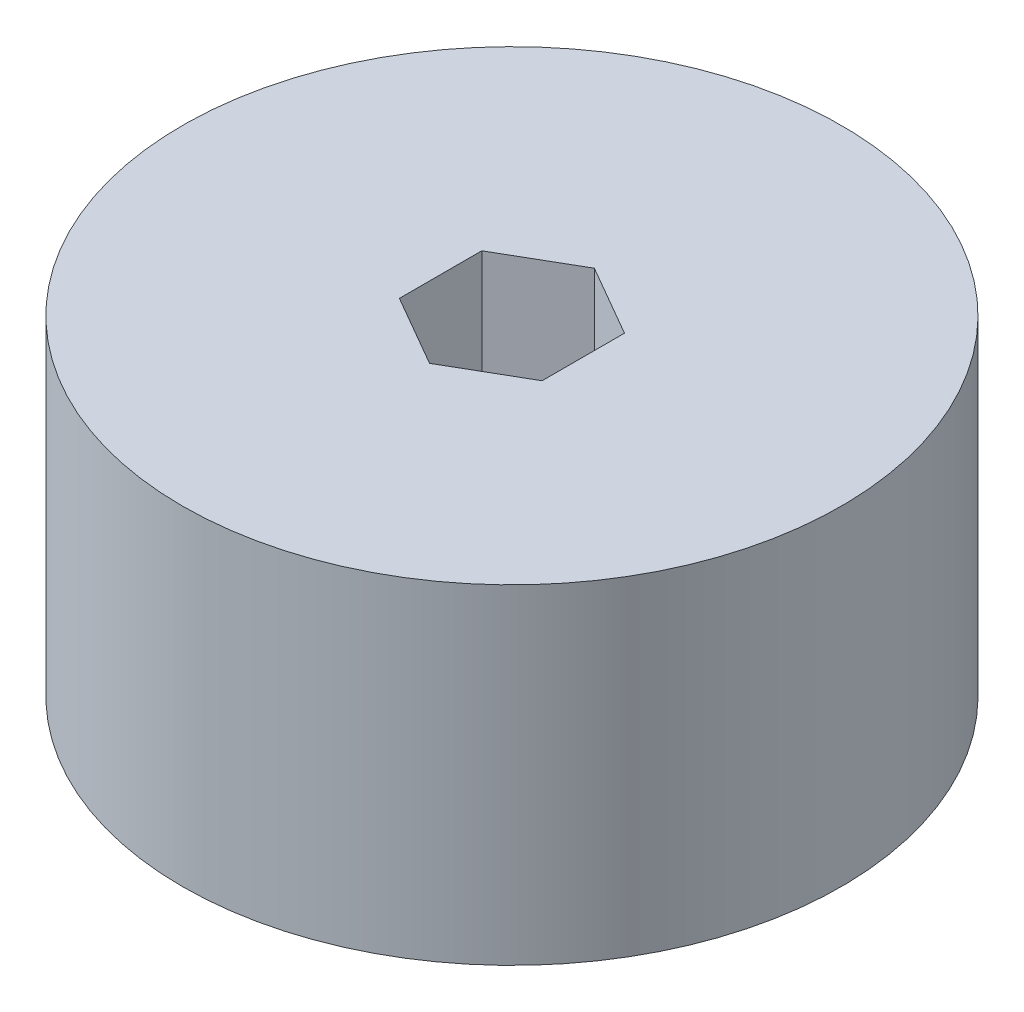
ISO-10303-21;
HEADER;
FILE_DESCRIPTION(('STEP AP214'),'2;1');
FILE_NAME('part.step','',(''),(''),'','','');
FILE_SCHEMA(('AUTOMOTIVE_DESIGN { 1 0 10303 214 1 1 1 1 }'));
ENDSEC;
DATA;
#1=APPLICATION_CONTEXT('core data for automotive mechanical design processes');
#2=APPLICATION_PROTOCOL_DEFINITION('international standard','automotive_design',2000,#1);
#3=PRODUCT_CONTEXT('',#1,'mechanical');
#4=PRODUCT('Part','Part','',(#3));
#5=PRODUCT_RELATED_PRODUCT_CATEGORY('part','',(#4));
#6=PRODUCT_DEFINITION_FORMATION('','',#4);
#7=PRODUCT_DEFINITION_CONTEXT('part definition',#1,'design');
#8=PRODUCT_DEFINITION('design','',#6,#7);
#9=PRODUCT_DEFINITION_SHAPE('','',#8);
#10=(LENGTH_UNIT() NAMED_UNIT(*) SI_UNIT(.MILLI.,.METRE.));
#11=(NAMED_UNIT(*) PLANE_ANGLE_UNIT() SI_UNIT($,.RADIAN.));
#12=(NAMED_UNIT(*) SI_UNIT($,.STERADIAN.) SOLID_ANGLE_UNIT());
#13=UNCERTAINTY_MEASURE_WITH_UNIT(LENGTH_MEASURE(1.E-05),#10,'distance_accuracy_value','');
#14=(GEOMETRIC_REPRESENTATION_CONTEXT(3) GLOBAL_UNCERTAINTY_ASSIGNED_CONTEXT((#13)) GLOBAL_UNIT_ASSIGNED_CONTEXT((#10,
#11,#12)) REPRESENTATION_CONTEXT('',''));
#15=CARTESIAN_POINT('',(0.,0.,0.));
#16=DIRECTION('',(0.,0.,1.));
#17=DIRECTION('',(1.,0.,0.));
#18=AXIS2_PLACEMENT_3D('',#15,#16,#17);
#19=CARTESIAN_POINT('',(0.,25.4,0.));
#20=DIRECTION('',(0.,1.,0.));
#21=DIRECTION('',(0.,0.,1.));
#22=AXIS2_PLACEMENT_3D('',#19,#20,#21);
#23=PLANE('',#22);
#24=CARTESIAN_POINT('',(0.,25.4,0.));
#25=DIRECTION('',(0.,1.,0.));
#26=DIRECTION('',(0.,0.,1.));
#27=AXIS2_PLACEMENT_3D('',#24,#25,#26);
#28=CIRCLE('',#27,25.4);
#29=CARTESIAN_POINT('',(0.,25.4,25.4));
#30=VERTEX_POINT('',#29);
#31=EDGE_CURVE('E11',#30,#30,#28,.T.);
#32=ORIENTED_EDGE('',*,*,#31,.T.);
#33=EDGE_LOOP('',(#32));
#34=FACE_BOUND('',#33,.T.);
#35=DIRECTION('',(0.,0.,-1.));
#36=VECTOR('',#35,1.);
#37=CARTESIAN_POINT('',(5.49926131403118,25.4,3.175));
#38=LINE('',#37,#36);
#39=CARTESIAN_POINT('',(5.49926131403118,25.4,3.175));
#40=VERTEX_POINT('',#39);
#41=CARTESIAN_POINT('',(5.49926131403118,25.4,-3.17500000000001));
#42=VERTEX_POINT('',#41);
#43=EDGE_CURVE('E93',#40,#42,#38,.T.);
#44=ORIENTED_EDGE('',*,*,#43,.F.);
#45=DIRECTION('',(0.866025403784439,0.,-0.5));
#46=VECTOR('',#45,1.);
#47=CARTESIAN_POINT('',(0.,25.4,6.35));
#48=LINE('',#47,#46);
#49=CARTESIAN_POINT('',(0.,25.4,6.35));
#50=VERTEX_POINT('',#49);
#51=EDGE_CURVE('E85',#50,#40,#48,.T.);
#52=ORIENTED_EDGE('',*,*,#51,.F.);
#53=DIRECTION('',(0.866025403784439,0.,0.5));
#54=VECTOR('',#53,1.);
#55=CARTESIAN_POINT('',(-5.49926131403118,25.4,3.175));
#56=LINE('',#55,#54);
#57=CARTESIAN_POINT('',(-5.49926131403118,25.4,3.175));
#58=VERTEX_POINT('',#57);
#59=EDGE_CURVE('E113',#58,#50,#56,.T.);
#60=ORIENTED_EDGE('',*,*,#59,.F.);
#61=DIRECTION('',(0.,0.,1.));
#62=VECTOR('',#61,1.);
#63=CARTESIAN_POINT('',(-5.49926131403119,25.4,-3.17500000000001));
#64=LINE('',#63,#62);
#65=CARTESIAN_POINT('',(-5.49926131403119,25.4,-3.17500000000001));
#66=VERTEX_POINT('',#65);
#67=EDGE_CURVE('E111',#66,#58,#64,.T.);
#68=ORIENTED_EDGE('',*,*,#67,.F.);
#69=DIRECTION('',(-0.866025403784439,0.,0.5));
#70=VECTOR('',#69,1.);
#71=CARTESIAN_POINT('',(0.,25.4,-6.35));
#72=LINE('',#71,#70);
#73=CARTESIAN_POINT('',(0.,25.4,-6.35));
#74=VERTEX_POINT('',#73);
#75=EDGE_CURVE('E107',#74,#66,#72,.T.);
#76=ORIENTED_EDGE('',*,*,#75,.F.);
#77=DIRECTION('',(-0.866025403784439,0.,-0.5));
#78=VECTOR('',#77,1.);
#79=CARTESIAN_POINT('',(5.49926131403118,25.4,-3.17500000000001));
#80=LINE('',#79,#78);
#81=EDGE_CURVE('E105',#42,#74,#80,.T.);
#82=ORIENTED_EDGE('',*,*,#81,.F.);
#83=EDGE_LOOP('',(#44,#52,#60,#68,#76,#82));
#84=FACE_BOUND('',#83,.T.);
#85=ADVANCED_FACE('F32',(#34,#84),#23,.T.);
#86=CARTESIAN_POINT('',(0.,0.,0.));
#87=DIRECTION('',(0.,1.,0.));
#88=DIRECTION('',(0.,0.,1.));
#89=AXIS2_PLACEMENT_3D('',#86,#87,#88);
#90=PLANE('',#89);
#91=CARTESIAN_POINT('',(0.,0.,0.));
#92=DIRECTION('',(0.,1.,0.));
#93=DIRECTION('',(0.,0.,1.));
#94=AXIS2_PLACEMENT_3D('',#91,#92,#93);
#95=CIRCLE('',#94,25.4);
#96=CARTESIAN_POINT('',(0.,0.,25.4));
#97=VERTEX_POINT('',#96);
#98=EDGE_CURVE('E36',#97,#97,#95,.T.);
#99=ORIENTED_EDGE('',*,*,#98,.F.);
#100=EDGE_LOOP('',(#99));
#101=FACE_BOUND('',#100,.T.);
#102=DIRECTION('',(0.866025403784439,0.,-0.5));
#103=VECTOR('',#102,1.);
#104=CARTESIAN_POINT('',(0.,0.,6.35));
#105=LINE('',#104,#103);
#106=CARTESIAN_POINT('',(0.,0.,6.35));
#107=VERTEX_POINT('',#106);
#108=CARTESIAN_POINT('',(5.49926131403118,0.,3.175));
#109=VERTEX_POINT('',#108);
#110=EDGE_CURVE('E55',#107,#109,#105,.T.);
#111=ORIENTED_EDGE('',*,*,#110,.T.);
#112=DIRECTION('',(0.,0.,-1.));
#113=VECTOR('',#112,1.);
#114=CARTESIAN_POINT('',(5.49926131403118,0.,3.175));
#115=LINE('',#114,#113);
#116=CARTESIAN_POINT('',(5.49926131403118,0.,-3.17500000000001));
#117=VERTEX_POINT('',#116);
#118=EDGE_CURVE('E100',#109,#117,#115,.T.);
#119=ORIENTED_EDGE('',*,*,#118,.T.);
#120=DIRECTION('',(-0.866025403784439,0.,-0.5));
#121=VECTOR('',#120,1.);
#122=CARTESIAN_POINT('',(5.49926131403118,0.,-3.17500000000001));
#123=LINE('',#122,#121);
#124=CARTESIAN_POINT('',(0.,0.,-6.35));
#125=VERTEX_POINT('',#124);
#126=EDGE_CURVE('E117',#117,#125,#123,.T.);
#127=ORIENTED_EDGE('',*,*,#126,.T.);
#128=DIRECTION('',(-0.866025403784439,0.,0.5));
#129=VECTOR('',#128,1.);
#130=CARTESIAN_POINT('',(0.,0.,-6.35));
#131=LINE('',#130,#129);
#132=CARTESIAN_POINT('',(-5.49926131403119,0.,-3.17500000000001));
#133=VERTEX_POINT('',#132);
#134=EDGE_CURVE('E120',#125,#133,#131,.T.);
#135=ORIENTED_EDGE('',*,*,#134,.T.);
#136=DIRECTION('',(0.,0.,1.));
#137=VECTOR('',#136,1.);
#138=CARTESIAN_POINT('',(-5.49926131403119,0.,-3.17500000000001));
#139=LINE('',#138,#137);
#140=CARTESIAN_POINT('',(-5.49926131403118,0.,3.175));
#141=VERTEX_POINT('',#140);
#142=EDGE_CURVE('E123',#133,#141,#139,.T.);
#143=ORIENTED_EDGE('',*,*,#142,.T.);
#144=DIRECTION('',(0.866025403784439,0.,0.5));
#145=VECTOR('',#144,1.);
#146=CARTESIAN_POINT('',(-5.49926131403118,0.,3.175));
#147=LINE('',#146,#145);
#148=EDGE_CURVE('E94',#141,#107,#147,.T.);
#149=ORIENTED_EDGE('',*,*,#148,.T.);
#150=EDGE_LOOP('',(#111,#119,#127,#135,#143,#149));
#151=FACE_BOUND('',#150,.T.);
#152=ADVANCED_FACE('F140',(#101,#151),#90,.F.);
#153=CARTESIAN_POINT('',(0.,25.4,0.));
#154=DIRECTION('',(0.,-1.,0.));
#155=DIRECTION('',(0.,0.,-1.));
#156=AXIS2_PLACEMENT_3D('',#153,#154,#155);
#157=CYLINDRICAL_SURFACE('',#156,25.4);
#158=ORIENTED_EDGE('',*,*,#31,.F.);
#159=EDGE_LOOP('',(#158));
#160=FACE_BOUND('',#159,.T.);
#161=ORIENTED_EDGE('',*,*,#98,.T.);
#162=EDGE_LOOP('',(#161));
#163=FACE_BOUND('',#162,.T.);
#164=ADVANCED_FACE('F34',(#160,#163),#157,.T.);
#165=CARTESIAN_POINT('',(0.,25.4,6.35));
#166=DIRECTION('',(-0.5,0.,-0.866025403784439));
#167=DIRECTION('',(-0.866025403784439,0.,0.5));
#168=AXIS2_PLACEMENT_3D('',#165,#166,#167);
#169=PLANE('',#168);
#170=ORIENTED_EDGE('',*,*,#110,.F.);
#171=DIRECTION('',(0.,-1.,0.));
#172=VECTOR('',#171,1.);
#173=CARTESIAN_POINT('',(0.,25.4,6.35));
#174=LINE('',#173,#172);
#175=EDGE_CURVE('E89',#50,#107,#174,.T.);
#176=ORIENTED_EDGE('',*,*,#175,.F.);
#177=ORIENTED_EDGE('',*,*,#51,.T.);
#178=DIRECTION('',(0.,-1.,0.));
#179=VECTOR('',#178,1.);
#180=CARTESIAN_POINT('',(5.49926131403118,25.4,3.175));
#181=LINE('',#180,#179);
#182=EDGE_CURVE('E88',#40,#109,#181,.T.);
#183=ORIENTED_EDGE('',*,*,#182,.T.);
#184=EDGE_LOOP('',(#170,#176,#177,#183));
#185=FACE_BOUND('',#184,.T.);
#186=ADVANCED_FACE('F87',(#185),#169,.T.);
#187=CARTESIAN_POINT('',(5.49926131403118,25.4,3.175));
#188=DIRECTION('',(-1.,0.,0.));
#189=DIRECTION('',(0.,0.,1.));
#190=AXIS2_PLACEMENT_3D('',#187,#188,#189);
#191=PLANE('',#190);
#192=ORIENTED_EDGE('',*,*,#118,.F.);
#193=ORIENTED_EDGE('',*,*,#182,.F.);
#194=ORIENTED_EDGE('',*,*,#43,.T.);
#195=DIRECTION('',(0.,-1.,0.));
#196=VECTOR('',#195,1.);
#197=CARTESIAN_POINT('',(5.49926131403118,25.4,-3.17500000000001));
#198=LINE('',#197,#196);
#199=EDGE_CURVE('E101',#42,#117,#198,.T.);
#200=ORIENTED_EDGE('',*,*,#199,.T.);
#201=EDGE_LOOP('',(#192,#193,#194,#200));
#202=FACE_BOUND('',#201,.T.);
#203=ADVANCED_FACE('F97',(#202),#191,.T.);
#204=CARTESIAN_POINT('',(5.49926131403118,25.4,-3.17500000000001));
#205=DIRECTION('',(-0.5,0.,0.866025403784439));
#206=DIRECTION('',(0.866025403784439,0.,0.5));
#207=AXIS2_PLACEMENT_3D('',#204,#205,#206);
#208=PLANE('',#207);
#209=ORIENTED_EDGE('',*,*,#126,.F.);
#210=ORIENTED_EDGE('',*,*,#199,.F.);
#211=ORIENTED_EDGE('',*,*,#81,.T.);
#212=DIRECTION('',(0.,-1.,0.));
#213=VECTOR('',#212,1.);
#214=CARTESIAN_POINT('',(0.,25.4,-6.35));
#215=LINE('',#214,#213);
#216=EDGE_CURVE('E132',#74,#125,#215,.T.);
#217=ORIENTED_EDGE('',*,*,#216,.T.);
#218=EDGE_LOOP('',(#209,#210,#211,#217));
#219=FACE_BOUND('',#218,.T.);
#220=ADVANCED_FACE('F136',(#219),#208,.T.);
#221=CARTESIAN_POINT('',(0.,25.4,-6.35));
#222=DIRECTION('',(0.5,0.,0.866025403784439));
#223=DIRECTION('',(0.866025403784439,0.,-0.5));
#224=AXIS2_PLACEMENT_3D('',#221,#222,#223);
#225=PLANE('',#224);
#226=ORIENTED_EDGE('',*,*,#134,.F.);
#227=ORIENTED_EDGE('',*,*,#216,.F.);
#228=ORIENTED_EDGE('',*,*,#75,.T.);
#229=DIRECTION('',(0.,-1.,0.));
#230=VECTOR('',#229,1.);
#231=CARTESIAN_POINT('',(-5.49926131403119,25.4,-3.17500000000001));
#232=LINE('',#231,#230);
#233=EDGE_CURVE('E130',#66,#133,#232,.T.);
#234=ORIENTED_EDGE('',*,*,#233,.T.);
#235=EDGE_LOOP('',(#226,#227,#228,#234));
#236=FACE_BOUND('',#235,.T.);
#237=ADVANCED_FACE('F148',(#236),#225,.T.);
#238=CARTESIAN_POINT('',(-5.49926131403119,25.4,-3.17500000000001));
#239=DIRECTION('',(1.,0.,0.));
#240=DIRECTION('',(0.,0.,-1.));
#241=AXIS2_PLACEMENT_3D('',#238,#239,#240);
#242=PLANE('',#241);
#243=ORIENTED_EDGE('',*,*,#142,.F.);
#244=ORIENTED_EDGE('',*,*,#233,.F.);
#245=ORIENTED_EDGE('',*,*,#67,.T.);
#246=DIRECTION('',(0.,-1.,0.));
#247=VECTOR('',#246,1.);
#248=CARTESIAN_POINT('',(-5.49926131403118,25.4,3.175));
#249=LINE('',#248,#247);
#250=EDGE_CURVE('E47',#58,#141,#249,.T.);
#251=ORIENTED_EDGE('',*,*,#250,.T.);
#252=EDGE_LOOP('',(#243,#244,#245,#251));
#253=FACE_BOUND('',#252,.T.);
#254=ADVANCED_FACE('F146',(#253),#242,.T.);
#255=CARTESIAN_POINT('',(-5.49926131403118,25.4,3.175));
#256=DIRECTION('',(0.5,0.,-0.866025403784439));
#257=DIRECTION('',(-0.866025403784439,0.,-0.5));
#258=AXIS2_PLACEMENT_3D('',#255,#256,#257);
#259=PLANE('',#258);
#260=ORIENTED_EDGE('',*,*,#148,.F.);
#261=ORIENTED_EDGE('',*,*,#250,.F.);
#262=ORIENTED_EDGE('',*,*,#59,.T.);
#263=ORIENTED_EDGE('',*,*,#175,.T.);
#264=EDGE_LOOP('',(#260,#261,#262,#263));
#265=FACE_BOUND('',#264,.T.);
#266=ADVANCED_FACE('F142',(#265),#259,.T.);
#267=CLOSED_SHELL('',(#85,#152,#164,#186,#203,#220,#237,#254,#266));
#268=MANIFOLD_SOLID_BREP('B2',#267);
#269=ADVANCED_BREP_SHAPE_REPRESENTATION('',(#18,#268),#14);
#270=SHAPE_DEFINITION_REPRESENTATION(#9,#269);
ENDSEC;
END-ISO-10303-21;
